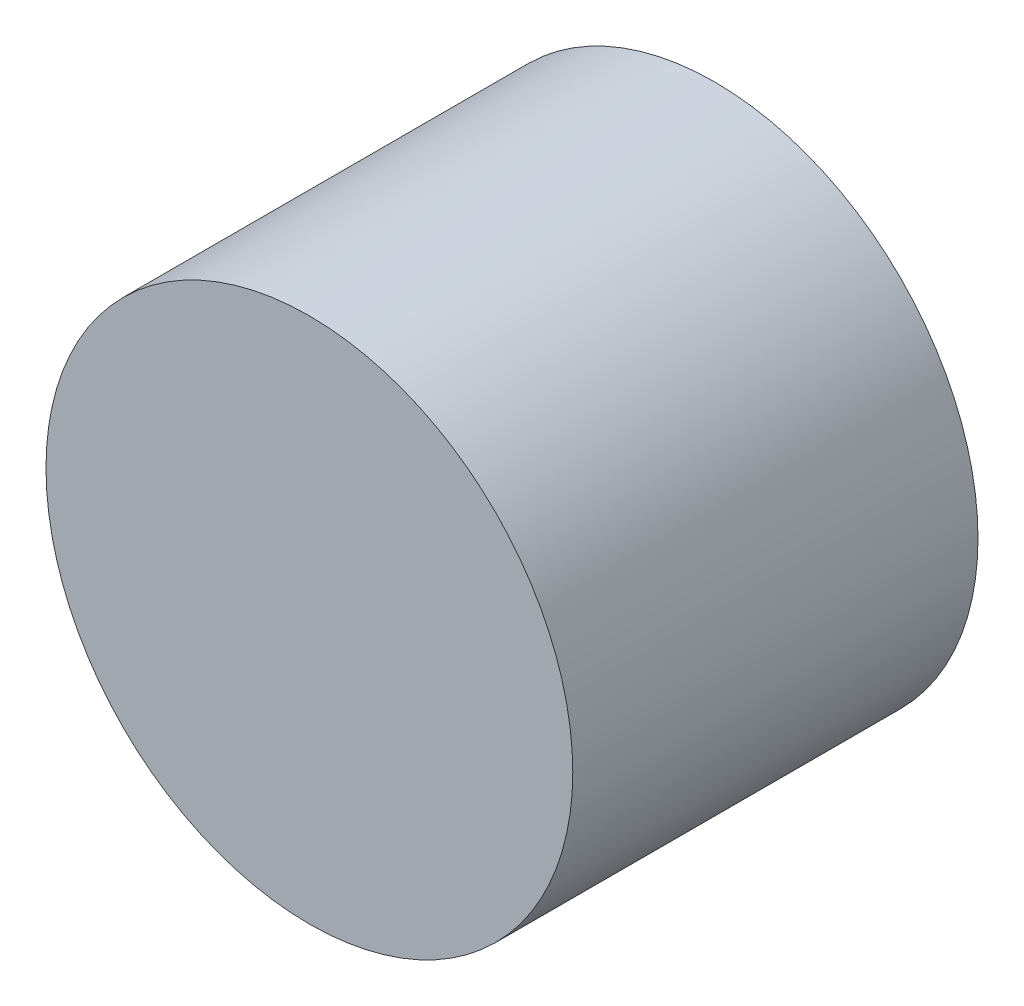
ISO-10303-21;
HEADER;
FILE_DESCRIPTION(('STEP AP214'),'2;1');
FILE_NAME('part.step','',(''),(''),'','','');
FILE_SCHEMA(('AUTOMOTIVE_DESIGN { 1 0 10303 214 1 1 1 1 }'));
ENDSEC;
DATA;
#1=APPLICATION_CONTEXT('core data for automotive mechanical design processes');
#2=APPLICATION_PROTOCOL_DEFINITION('international standard','automotive_design',2000,#1);
#3=PRODUCT_CONTEXT('',#1,'mechanical');
#4=PRODUCT('Part','Part','',(#3));
#5=PRODUCT_RELATED_PRODUCT_CATEGORY('part','',(#4));
#6=PRODUCT_DEFINITION_FORMATION('','',#4);
#7=PRODUCT_DEFINITION_CONTEXT('part definition',#1,'design');
#8=PRODUCT_DEFINITION('design','',#6,#7);
#9=PRODUCT_DEFINITION_SHAPE('','',#8);
#10=(LENGTH_UNIT() NAMED_UNIT(*) SI_UNIT(.MILLI.,.METRE.));
#11=(NAMED_UNIT(*) PLANE_ANGLE_UNIT() SI_UNIT($,.RADIAN.));
#12=(NAMED_UNIT(*) SI_UNIT($,.STERADIAN.) SOLID_ANGLE_UNIT());
#13=UNCERTAINTY_MEASURE_WITH_UNIT(LENGTH_MEASURE(1.E-05),#10,'distance_accuracy_value','');
#14=(GEOMETRIC_REPRESENTATION_CONTEXT(3) GLOBAL_UNCERTAINTY_ASSIGNED_CONTEXT((#13)) GLOBAL_UNIT_ASSIGNED_CONTEXT((#10,
#11,#12)) REPRESENTATION_CONTEXT('',''));
#15=CARTESIAN_POINT('',(0.,0.,0.));
#16=DIRECTION('',(0.,0.,1.));
#17=DIRECTION('',(1.,0.,0.));
#18=AXIS2_PLACEMENT_3D('',#15,#16,#17);
#19=CARTESIAN_POINT('',(0.,0.,6.35085296108584));
#20=DIRECTION('',(0.,0.,-1.));
#21=DIRECTION('',(-1.,0.,0.));
#22=AXIS2_PLACEMENT_3D('',#19,#20,#21);
#23=CONICAL_SURFACE('',#22,0.,1.0471975511966);
#24=CARTESIAN_POINT('',(0.,0.,0.));
#25=DIRECTION('',(0.,0.,1.));
#26=DIRECTION('',(1.,0.,0.));
#27=AXIS2_PLACEMENT_3D('',#24,#25,#26);
#28=CIRCLE('',#27,11.);
#29=CARTESIAN_POINT('',(11.,0.,0.));
#30=VERTEX_POINT('',#29);
#31=EDGE_CURVE('E11',#30,#30,#28,.T.);
#32=ORIENTED_EDGE('',*,*,#31,.F.);
#33=EDGE_LOOP('',(#32));
#34=FACE_BOUND('',#33,.T.);
#35=CARTESIAN_POINT('',(0.,0.,6.35085296108585));
#36=VERTEX_POINT('',#35);
#37=VERTEX_LOOP('',#36);
#38=FACE_BOUND('',#37,.T.);
#39=ADVANCED_FACE('F36',(#34,#38),#23,.F.);
#40=CARTESIAN_POINT('',(0.,11.,0.));
#41=DIRECTION('',(0.,0.,1.));
#42=DIRECTION('',(1.,0.,0.));
#43=AXIS2_PLACEMENT_3D('',#40,#41,#42);
#44=PLANE('',#43);
#45=CARTESIAN_POINT('',(0.,0.,0.));
#46=DIRECTION('',(0.,0.,1.));
#47=DIRECTION('',(1.,0.,0.));
#48=AXIS2_PLACEMENT_3D('',#45,#46,#47);
#49=CIRCLE('',#48,13.);
#50=CARTESIAN_POINT('',(13.,0.,0.));
#51=VERTEX_POINT('',#50);
#52=EDGE_CURVE('E42',#51,#51,#49,.T.);
#53=ORIENTED_EDGE('',*,*,#52,.F.);
#54=EDGE_LOOP('',(#53));
#55=FACE_BOUND('',#54,.T.);
#56=ORIENTED_EDGE('',*,*,#31,.T.);
#57=EDGE_LOOP('',(#56));
#58=FACE_BOUND('',#57,.T.);
#59=ADVANCED_FACE('F46',(#55,#58),#44,.F.);
#60=CARTESIAN_POINT('',(0.,0.,1000.));
#61=DIRECTION('',(0.,0.,1.));
#62=DIRECTION('',(1.,0.,0.));
#63=AXIS2_PLACEMENT_3D('',#60,#61,#62);
#64=CYLINDRICAL_SURFACE('',#63,13.);
#65=CARTESIAN_POINT('',(0.,0.,20.));
#66=DIRECTION('',(0.,0.,1.));
#67=DIRECTION('',(1.,0.,0.));
#68=AXIS2_PLACEMENT_3D('',#65,#66,#67);
#69=CIRCLE('',#68,13.);
#70=CARTESIAN_POINT('',(13.,0.,20.));
#71=VERTEX_POINT('',#70);
#72=EDGE_CURVE('E69',#71,#71,#69,.T.);
#73=ORIENTED_EDGE('',*,*,#72,.F.);
#74=EDGE_LOOP('',(#73));
#75=FACE_BOUND('',#74,.T.);
#76=ORIENTED_EDGE('',*,*,#52,.T.);
#77=EDGE_LOOP('',(#76));
#78=FACE_BOUND('',#77,.T.);
#79=ADVANCED_FACE('F51',(#75,#78),#64,.T.);
#80=CARTESIAN_POINT('',(0.,13.,20.));
#81=DIRECTION('',(0.,0.,-1.));
#82=DIRECTION('',(-1.,0.,0.));
#83=AXIS2_PLACEMENT_3D('',#80,#81,#82);
#84=PLANE('',#83);
#85=ORIENTED_EDGE('',*,*,#72,.T.);
#86=EDGE_LOOP('',(#85));
#87=FACE_BOUND('',#86,.T.);
#88=ADVANCED_FACE('F58',(#87),#84,.F.);
#89=CLOSED_SHELL('',(#39,#59,#79,#88));
#90=MANIFOLD_SOLID_BREP('B2',#89);
#91=ADVANCED_BREP_SHAPE_REPRESENTATION('',(#18,#90),#14);
#92=SHAPE_DEFINITION_REPRESENTATION(#9,#91);
ENDSEC;
END-ISO-10303-21;
